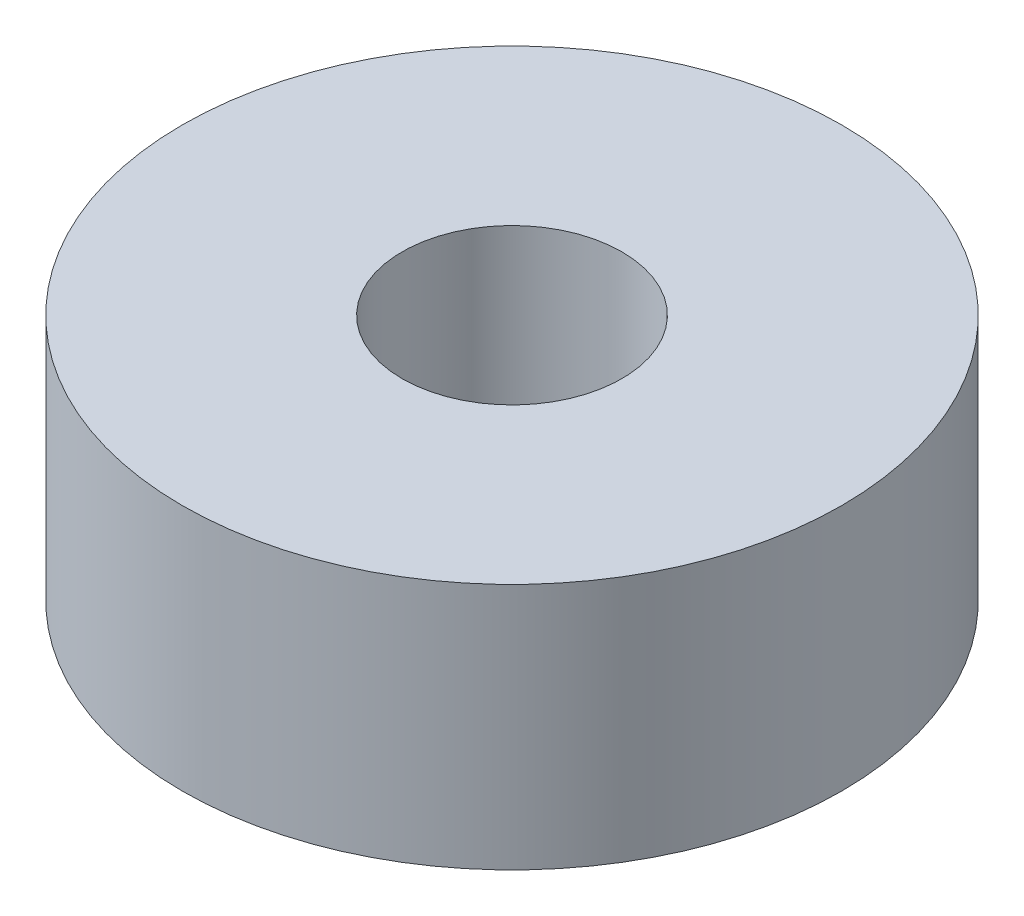
ISO-10303-21;
HEADER;
FILE_DESCRIPTION(('STEP AP214'),'2;1');
FILE_NAME('part.step','',(''),(''),'','','');
FILE_SCHEMA(('AUTOMOTIVE_DESIGN { 1 0 10303 214 1 1 1 1 }'));
ENDSEC;
DATA;
#1=APPLICATION_CONTEXT('core data for automotive mechanical design processes');
#2=APPLICATION_PROTOCOL_DEFINITION('international standard','automotive_design',2000,#1);
#3=PRODUCT_CONTEXT('',#1,'mechanical');
#4=PRODUCT('Part','Part','',(#3));
#5=PRODUCT_RELATED_PRODUCT_CATEGORY('part','',(#4));
#6=PRODUCT_DEFINITION_FORMATION('','',#4);
#7=PRODUCT_DEFINITION_CONTEXT('part definition',#1,'design');
#8=PRODUCT_DEFINITION('design','',#6,#7);
#9=PRODUCT_DEFINITION_SHAPE('','',#8);
#10=(LENGTH_UNIT() NAMED_UNIT(*) SI_UNIT(.MILLI.,.METRE.));
#11=(NAMED_UNIT(*) PLANE_ANGLE_UNIT() SI_UNIT($,.RADIAN.));
#12=(NAMED_UNIT(*) SI_UNIT($,.STERADIAN.) SOLID_ANGLE_UNIT());
#13=UNCERTAINTY_MEASURE_WITH_UNIT(LENGTH_MEASURE(1.E-05),#10,'distance_accuracy_value','');
#14=(GEOMETRIC_REPRESENTATION_CONTEXT(3) GLOBAL_UNCERTAINTY_ASSIGNED_CONTEXT((#13)) GLOBAL_UNIT_ASSIGNED_CONTEXT((#10,
#11,#12)) REPRESENTATION_CONTEXT('',''));
#15=CARTESIAN_POINT('',(0.,0.,0.));
#16=DIRECTION('',(0.,0.,1.));
#17=DIRECTION('',(1.,0.,0.));
#18=AXIS2_PLACEMENT_3D('',#15,#16,#17);
#19=CARTESIAN_POINT('',(0.,9.,0.));
#20=DIRECTION('',(0.,1.,0.));
#21=DIRECTION('',(0.,0.,1.));
#22=AXIS2_PLACEMENT_3D('',#19,#20,#21);
#23=PLANE('',#22);
#24=CARTESIAN_POINT('',(0.,9.,0.));
#25=DIRECTION('',(0.,1.,0.));
#26=DIRECTION('',(0.,0.,1.));
#27=AXIS2_PLACEMENT_3D('',#24,#25,#26);
#28=CIRCLE('',#27,12.);
#29=CARTESIAN_POINT('',(0.,9.,12.));
#30=VERTEX_POINT('',#29);
#31=EDGE_CURVE('E10',#30,#30,#28,.T.);
#32=ORIENTED_EDGE('',*,*,#31,.T.);
#33=EDGE_LOOP('',(#32));
#34=FACE_BOUND('',#33,.T.);
#35=CARTESIAN_POINT('',(0.,9.,0.));
#36=DIRECTION('',(0.,1.,0.));
#37=DIRECTION('',(0.,0.,1.));
#38=AXIS2_PLACEMENT_3D('',#35,#36,#37);
#39=CIRCLE('',#38,4.);
#40=CARTESIAN_POINT('',(0.,9.,4.));
#41=VERTEX_POINT('',#40);
#42=EDGE_CURVE('E43',#41,#41,#39,.T.);
#43=ORIENTED_EDGE('',*,*,#42,.F.);
#44=EDGE_LOOP('',(#43));
#45=FACE_BOUND('',#44,.T.);
#46=ADVANCED_FACE('F32',(#34,#45),#23,.T.);
#47=CARTESIAN_POINT('',(0.,0.,0.));
#48=DIRECTION('',(0.,1.,0.));
#49=DIRECTION('',(0.,0.,1.));
#50=AXIS2_PLACEMENT_3D('',#47,#48,#49);
#51=PLANE('',#50);
#52=CARTESIAN_POINT('',(0.,0.,0.));
#53=DIRECTION('',(0.,1.,0.));
#54=DIRECTION('',(0.,0.,1.));
#55=AXIS2_PLACEMENT_3D('',#52,#53,#54);
#56=CIRCLE('',#55,12.);
#57=CARTESIAN_POINT('',(0.,0.,12.));
#58=VERTEX_POINT('',#57);
#59=EDGE_CURVE('E36',#58,#58,#56,.T.);
#60=ORIENTED_EDGE('',*,*,#59,.F.);
#61=EDGE_LOOP('',(#60));
#62=FACE_BOUND('',#61,.T.);
#63=CARTESIAN_POINT('',(0.,0.,0.));
#64=DIRECTION('',(0.,1.,0.));
#65=DIRECTION('',(0.,0.,1.));
#66=AXIS2_PLACEMENT_3D('',#63,#64,#65);
#67=CIRCLE('',#66,4.);
#68=CARTESIAN_POINT('',(0.,0.,4.));
#69=VERTEX_POINT('',#68);
#70=EDGE_CURVE('E45',#69,#69,#67,.T.);
#71=ORIENTED_EDGE('',*,*,#70,.T.);
#72=EDGE_LOOP('',(#71));
#73=FACE_BOUND('',#72,.T.);
#74=ADVANCED_FACE('F55',(#62,#73),#51,.F.);
#75=CARTESIAN_POINT('',(0.,9.,0.));
#76=DIRECTION('',(0.,-1.,0.));
#77=DIRECTION('',(0.,0.,-1.));
#78=AXIS2_PLACEMENT_3D('',#75,#76,#77);
#79=CYLINDRICAL_SURFACE('',#78,12.);
#80=ORIENTED_EDGE('',*,*,#31,.F.);
#81=EDGE_LOOP('',(#80));
#82=FACE_BOUND('',#81,.T.);
#83=ORIENTED_EDGE('',*,*,#59,.T.);
#84=EDGE_LOOP('',(#83));
#85=FACE_BOUND('',#84,.T.);
#86=ADVANCED_FACE('F34',(#82,#85),#79,.T.);
#87=CARTESIAN_POINT('',(0.,9.,0.));
#88=DIRECTION('',(0.,-1.,0.));
#89=DIRECTION('',(0.,0.,-1.));
#90=AXIS2_PLACEMENT_3D('',#87,#88,#89);
#91=CYLINDRICAL_SURFACE('',#90,4.);
#92=ORIENTED_EDGE('',*,*,#42,.T.);
#93=EDGE_LOOP('',(#92));
#94=FACE_BOUND('',#93,.T.);
#95=ORIENTED_EDGE('',*,*,#70,.F.);
#96=EDGE_LOOP('',(#95));
#97=FACE_BOUND('',#96,.T.);
#98=ADVANCED_FACE('F51',(#94,#97),#91,.F.);
#99=CLOSED_SHELL('',(#46,#74,#86,#98));
#100=MANIFOLD_SOLID_BREP('B2',#99);
#101=ADVANCED_BREP_SHAPE_REPRESENTATION('',(#18,#100),#14);
#102=SHAPE_DEFINITION_REPRESENTATION(#9,#101);
ENDSEC;
END-ISO-10303-21;
